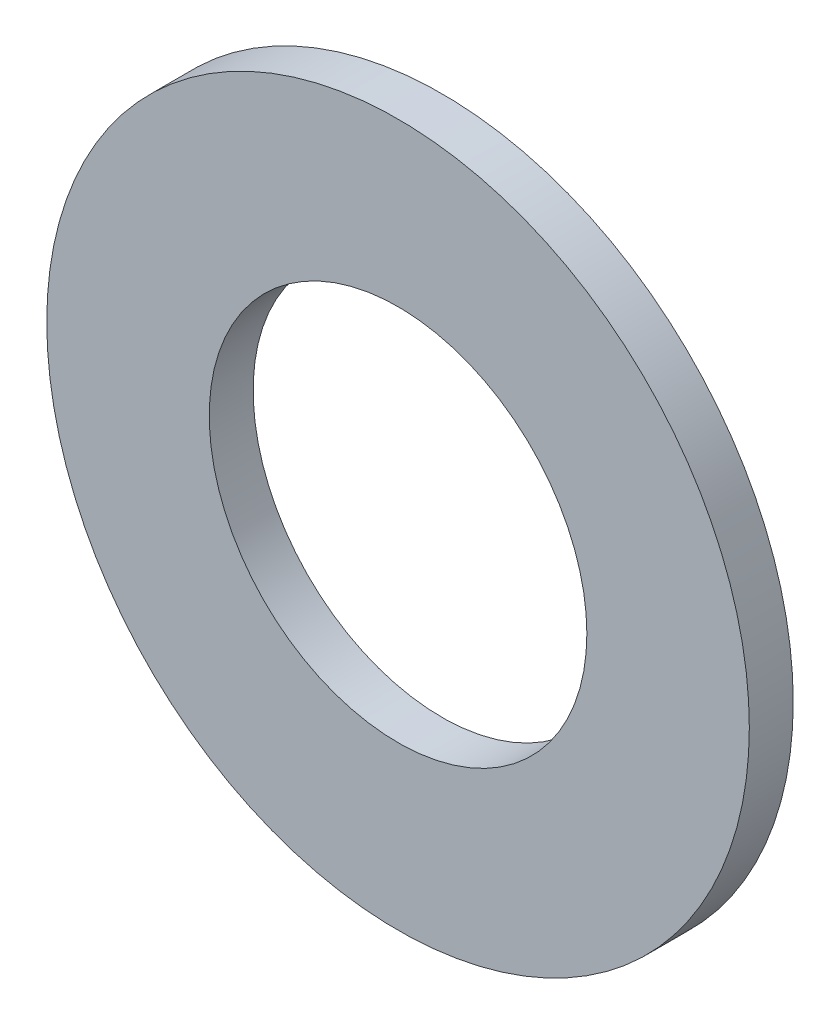
ISO-10303-21;
HEADER;
FILE_DESCRIPTION(('STEP AP214'),'2;1');
FILE_NAME('part.step','',(''),(''),'','','');
FILE_SCHEMA(('AUTOMOTIVE_DESIGN { 1 0 10303 214 1 1 1 1 }'));
ENDSEC;
DATA;
#1=APPLICATION_CONTEXT('core data for automotive mechanical design processes');
#2=APPLICATION_PROTOCOL_DEFINITION('international standard','automotive_design',2000,#1);
#3=PRODUCT_CONTEXT('',#1,'mechanical');
#4=PRODUCT('Part','Part','',(#3));
#5=PRODUCT_RELATED_PRODUCT_CATEGORY('part','',(#4));
#6=PRODUCT_DEFINITION_FORMATION('','',#4);
#7=PRODUCT_DEFINITION_CONTEXT('part definition',#1,'design');
#8=PRODUCT_DEFINITION('design','',#6,#7);
#9=PRODUCT_DEFINITION_SHAPE('','',#8);
#10=(LENGTH_UNIT() NAMED_UNIT(*) SI_UNIT(.MILLI.,.METRE.));
#11=(NAMED_UNIT(*) PLANE_ANGLE_UNIT() SI_UNIT($,.RADIAN.));
#12=(NAMED_UNIT(*) SI_UNIT($,.STERADIAN.) SOLID_ANGLE_UNIT());
#13=UNCERTAINTY_MEASURE_WITH_UNIT(LENGTH_MEASURE(1.E-05),#10,'distance_accuracy_value','');
#14=(GEOMETRIC_REPRESENTATION_CONTEXT(3) GLOBAL_UNCERTAINTY_ASSIGNED_CONTEXT((#13)) GLOBAL_UNIT_ASSIGNED_CONTEXT((#10,
#11,#12)) REPRESENTATION_CONTEXT('',''));
#15=CARTESIAN_POINT('',(0.,0.,0.));
#16=DIRECTION('',(0.,0.,1.));
#17=DIRECTION('',(1.,0.,0.));
#18=AXIS2_PLACEMENT_3D('',#15,#16,#17);
#19=CARTESIAN_POINT('',(0.,0.,0.5));
#20=DIRECTION('',(0.,0.,1.));
#21=DIRECTION('',(1.,0.,0.));
#22=AXIS2_PLACEMENT_3D('',#19,#20,#21);
#23=PLANE('',#22);
#24=CARTESIAN_POINT('',(0.,0.,0.5));
#25=DIRECTION('',(0.,0.,1.));
#26=DIRECTION('',(1.,0.,0.));
#27=AXIS2_PLACEMENT_3D('',#24,#25,#26);
#28=CIRCLE('',#27,4.);
#29=CARTESIAN_POINT('',(4.,0.,0.5));
#30=VERTEX_POINT('',#29);
#31=EDGE_CURVE('E10',#30,#30,#28,.T.);
#32=ORIENTED_EDGE('',*,*,#31,.T.);
#33=EDGE_LOOP('',(#32));
#34=FACE_BOUND('',#33,.T.);
#35=CARTESIAN_POINT('',(0.,0.,0.5));
#36=DIRECTION('',(0.,0.,1.));
#37=DIRECTION('',(1.,0.,0.));
#38=AXIS2_PLACEMENT_3D('',#35,#36,#37);
#39=CIRCLE('',#38,2.15);
#40=CARTESIAN_POINT('',(2.15,0.,0.5));
#41=VERTEX_POINT('',#40);
#42=EDGE_CURVE('E44',#41,#41,#39,.T.);
#43=ORIENTED_EDGE('',*,*,#42,.F.);
#44=EDGE_LOOP('',(#43));
#45=FACE_BOUND('',#44,.T.);
#46=ADVANCED_FACE('F33',(#34,#45),#23,.T.);
#47=CARTESIAN_POINT('',(0.,0.,0.));
#48=DIRECTION('',(0.,0.,1.));
#49=DIRECTION('',(1.,0.,0.));
#50=AXIS2_PLACEMENT_3D('',#47,#48,#49);
#51=PLANE('',#50);
#52=CARTESIAN_POINT('',(0.,0.,0.));
#53=DIRECTION('',(0.,0.,1.));
#54=DIRECTION('',(1.,0.,0.));
#55=AXIS2_PLACEMENT_3D('',#52,#53,#54);
#56=CIRCLE('',#55,4.);
#57=CARTESIAN_POINT('',(4.,0.,0.));
#58=VERTEX_POINT('',#57);
#59=EDGE_CURVE('E37',#58,#58,#56,.T.);
#60=ORIENTED_EDGE('',*,*,#59,.F.);
#61=EDGE_LOOP('',(#60));
#62=FACE_BOUND('',#61,.T.);
#63=CARTESIAN_POINT('',(0.,0.,0.));
#64=DIRECTION('',(0.,0.,1.));
#65=DIRECTION('',(1.,0.,0.));
#66=AXIS2_PLACEMENT_3D('',#63,#64,#65);
#67=CIRCLE('',#66,2.15);
#68=CARTESIAN_POINT('',(2.15,0.,0.));
#69=VERTEX_POINT('',#68);
#70=EDGE_CURVE('E46',#69,#69,#67,.T.);
#71=ORIENTED_EDGE('',*,*,#70,.T.);
#72=EDGE_LOOP('',(#71));
#73=FACE_BOUND('',#72,.T.);
#74=ADVANCED_FACE('F56',(#62,#73),#51,.F.);
#75=CARTESIAN_POINT('',(0.,0.,0.5));
#76=DIRECTION('',(0.,0.,-1.));
#77=DIRECTION('',(-1.,0.,0.));
#78=AXIS2_PLACEMENT_3D('',#75,#76,#77);
#79=CYLINDRICAL_SURFACE('',#78,4.);
#80=ORIENTED_EDGE('',*,*,#31,.F.);
#81=EDGE_LOOP('',(#80));
#82=FACE_BOUND('',#81,.T.);
#83=ORIENTED_EDGE('',*,*,#59,.T.);
#84=EDGE_LOOP('',(#83));
#85=FACE_BOUND('',#84,.T.);
#86=ADVANCED_FACE('F35',(#82,#85),#79,.T.);
#87=CARTESIAN_POINT('',(0.,0.,0.5));
#88=DIRECTION('',(0.,0.,-1.));
#89=DIRECTION('',(-1.,0.,0.));
#90=AXIS2_PLACEMENT_3D('',#87,#88,#89);
#91=CYLINDRICAL_SURFACE('',#90,2.15);
#92=ORIENTED_EDGE('',*,*,#42,.T.);
#93=EDGE_LOOP('',(#92));
#94=FACE_BOUND('',#93,.T.);
#95=ORIENTED_EDGE('',*,*,#70,.F.);
#96=EDGE_LOOP('',(#95));
#97=FACE_BOUND('',#96,.T.);
#98=ADVANCED_FACE('F52',(#94,#97),#91,.F.);
#99=CLOSED_SHELL('',(#46,#74,#86,#98));
#100=MANIFOLD_SOLID_BREP('B2',#99);
#101=ADVANCED_BREP_SHAPE_REPRESENTATION('',(#18,#100),#14);
#102=SHAPE_DEFINITION_REPRESENTATION(#9,#101);
ENDSEC;
END-ISO-10303-21;
